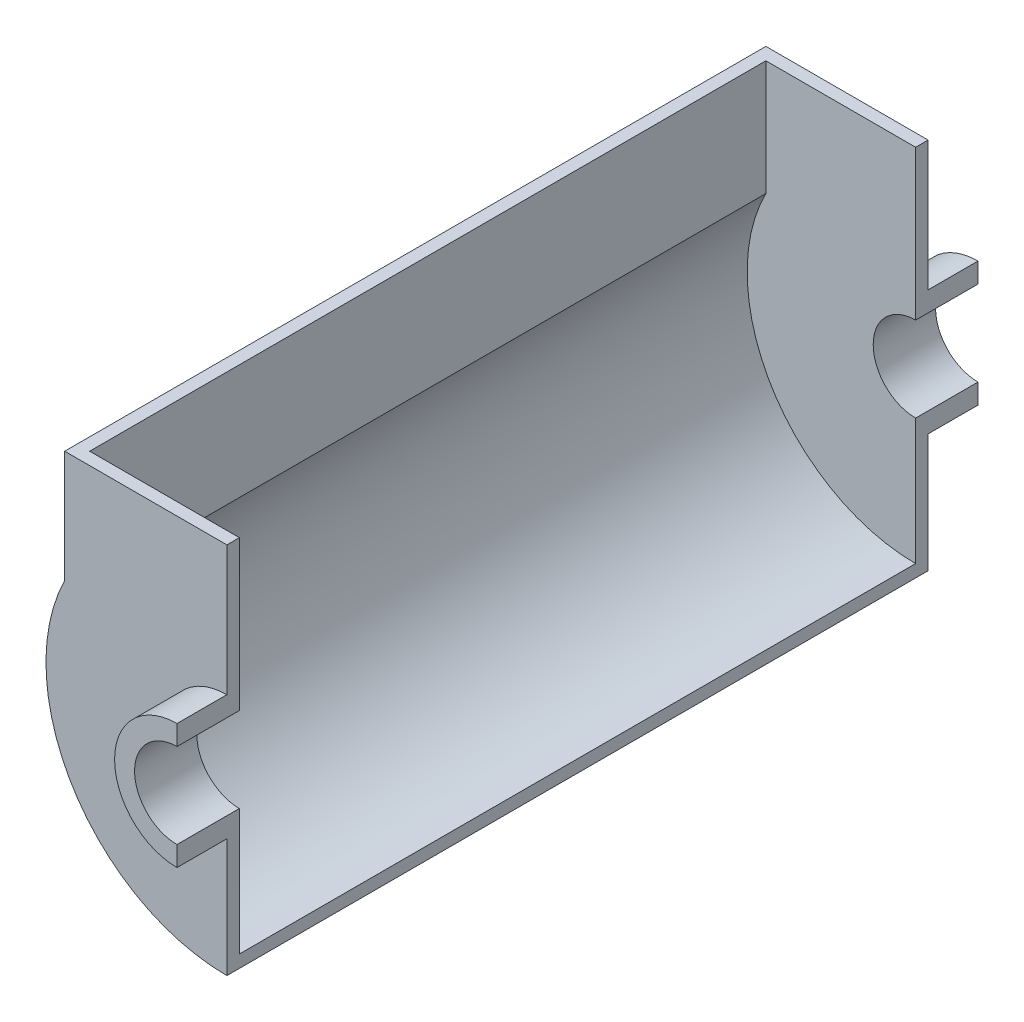
ISO-10303-21;
HEADER;
FILE_DESCRIPTION(('STEP AP214'),'2;1');
FILE_NAME('part.step','',(''),(''),'','','');
FILE_SCHEMA(('AUTOMOTIVE_DESIGN { 1 0 10303 214 1 1 1 1 }'));
ENDSEC;
DATA;
#1=APPLICATION_CONTEXT('core data for automotive mechanical design processes');
#2=APPLICATION_PROTOCOL_DEFINITION('international standard','automotive_design',2000,#1);
#3=PRODUCT_CONTEXT('',#1,'mechanical');
#4=PRODUCT('Part','Part','',(#3));
#5=PRODUCT_RELATED_PRODUCT_CATEGORY('part','',(#4));
#6=PRODUCT_DEFINITION_FORMATION('','',#4);
#7=PRODUCT_DEFINITION_CONTEXT('part definition',#1,'design');
#8=PRODUCT_DEFINITION('design','',#6,#7);
#9=PRODUCT_DEFINITION_SHAPE('','',#8);
#10=(LENGTH_UNIT() NAMED_UNIT(*) SI_UNIT(.MILLI.,.METRE.));
#11=(NAMED_UNIT(*) PLANE_ANGLE_UNIT() SI_UNIT($,.RADIAN.));
#12=(NAMED_UNIT(*) SI_UNIT($,.STERADIAN.) SOLID_ANGLE_UNIT());
#13=UNCERTAINTY_MEASURE_WITH_UNIT(LENGTH_MEASURE(1.E-05),#10,'distance_accuracy_value','');
#14=(GEOMETRIC_REPRESENTATION_CONTEXT(3) GLOBAL_UNCERTAINTY_ASSIGNED_CONTEXT((#13)) GLOBAL_UNIT_ASSIGNED_CONTEXT((#10,
#11,#12)) REPRESENTATION_CONTEXT('',''));
#15=CARTESIAN_POINT('',(0.,0.,0.));
#16=DIRECTION('',(0.,0.,1.));
#17=DIRECTION('',(1.,0.,0.));
#18=AXIS2_PLACEMENT_3D('',#15,#16,#17);
#19=CARTESIAN_POINT('',(0.,0.,-127.));
#20=DIRECTION('',(0.,0.,1.));
#21=DIRECTION('',(1.,0.,0.));
#22=AXIS2_PLACEMENT_3D('',#19,#20,#21);
#23=PLANE('',#22);
#24=CARTESIAN_POINT('',(0.,0.,-127.));
#25=DIRECTION('',(0.,0.,1.));
#26=DIRECTION('',(-1.,0.,0.));
#27=AXIS2_PLACEMENT_3D('',#24,#25,#26);
#28=CIRCLE('',#27,1714.5);
#29=CARTESIAN_POINT('',(-1524.,785.451621680164,-127.));
#30=VERTEX_POINT('',#29);
#31=CARTESIAN_POINT('',(0.,-1714.5,-127.));
#32=VERTEX_POINT('',#31);
#33=EDGE_CURVE('E196',#30,#32,#28,.T.);
#34=ORIENTED_EDGE('',*,*,#33,.F.);
#35=DIRECTION('',(0.,-1.,0.));
#36=VECTOR('',#35,1.);
#37=CARTESIAN_POINT('',(-1524.,1955.8,-127.));
#38=LINE('',#37,#36);
#39=CARTESIAN_POINT('',(-1524.,1955.8,-127.));
#40=VERTEX_POINT('',#39);
#41=EDGE_CURVE('E53',#40,#30,#38,.T.);
#42=ORIENTED_EDGE('',*,*,#41,.F.);
#43=DIRECTION('',(-1.,0.,0.));
#44=VECTOR('',#43,1.);
#45=CARTESIAN_POINT('',(0.,1955.8,-127.));
#46=LINE('',#45,#44);
#47=CARTESIAN_POINT('',(0.,1955.8,-127.));
#48=VERTEX_POINT('',#47);
#49=EDGE_CURVE('E212',#48,#40,#46,.T.);
#50=ORIENTED_EDGE('',*,*,#49,.F.);
#51=DIRECTION('',(0.,1.,0.));
#52=VECTOR('',#51,1.);
#53=CARTESIAN_POINT('',(0.,635.,-127.));
#54=LINE('',#53,#52);
#55=CARTESIAN_POINT('',(0.,431.8,-127.));
#56=VERTEX_POINT('',#55);
#57=EDGE_CURVE('E254',#56,#48,#54,.T.);
#58=ORIENTED_EDGE('',*,*,#57,.F.);
#59=CARTESIAN_POINT('',(0.,0.,-127.));
#60=DIRECTION('',(0.,0.,-1.));
#61=DIRECTION('',(1.,0.,0.));
#62=AXIS2_PLACEMENT_3D('',#59,#60,#61);
#63=CIRCLE('',#62,431.8);
#64=CARTESIAN_POINT('',(0.,-431.8,-127.));
#65=VERTEX_POINT('',#64);
#66=EDGE_CURVE('E251',#65,#56,#63,.T.);
#67=ORIENTED_EDGE('',*,*,#66,.F.);
#68=DIRECTION('',(0.,1.,0.));
#69=VECTOR('',#68,1.);
#70=CARTESIAN_POINT('',(0.,-431.8,-127.));
#71=LINE('',#70,#69);
#72=EDGE_CURVE('E59',#32,#65,#71,.T.);
#73=ORIENTED_EDGE('',*,*,#72,.F.);
#74=EDGE_LOOP('',(#34,#42,#50,#58,#67,#73));
#75=FACE_BOUND('',#74,.T.);
#76=ADVANCED_FACE('F36',(#75),#23,.F.);
#77=CARTESIAN_POINT('',(0.,0.,-127.));
#78=DIRECTION('',(0.,0.,1.));
#79=DIRECTION('',(1.,0.,0.));
#80=AXIS2_PLACEMENT_3D('',#77,#78,#79);
#81=CYLINDRICAL_SURFACE('',#80,431.8);
#82=DIRECTION('',(0.,0.,1.));
#83=VECTOR('',#82,1.);
#84=CARTESIAN_POINT('',(0.,431.8,-127.));
#85=LINE('',#84,#83);
#86=CARTESIAN_POINT('',(0.,431.8,508.));
#87=VERTEX_POINT('',#86);
#88=EDGE_CURVE('E40',#56,#87,#85,.T.);
#89=ORIENTED_EDGE('',*,*,#88,.T.);
#90=CARTESIAN_POINT('',(0.,0.,508.));
#91=DIRECTION('',(0.,0.,-1.));
#92=DIRECTION('',(1.,0.,0.));
#93=AXIS2_PLACEMENT_3D('',#90,#91,#92);
#94=CIRCLE('',#93,431.8);
#95=CARTESIAN_POINT('',(0.,-431.8,508.));
#96=VERTEX_POINT('',#95);
#97=EDGE_CURVE('E234',#96,#87,#94,.T.);
#98=ORIENTED_EDGE('',*,*,#97,.F.);
#99=DIRECTION('',(0.,0.,1.));
#100=VECTOR('',#99,1.);
#101=CARTESIAN_POINT('',(0.,-431.8,-127.));
#102=LINE('',#101,#100);
#103=EDGE_CURVE('E11',#65,#96,#102,.T.);
#104=ORIENTED_EDGE('',*,*,#103,.F.);
#105=ORIENTED_EDGE('',*,*,#66,.T.);
#106=EDGE_LOOP('',(#89,#98,#104,#105));
#107=FACE_BOUND('',#106,.T.);
#108=ADVANCED_FACE('F38',(#107),#81,.F.);
#109=CARTESIAN_POINT('',(0.,-431.8,-127.));
#110=DIRECTION('',(1.,0.,0.));
#111=DIRECTION('',(0.,0.,-1.));
#112=AXIS2_PLACEMENT_3D('',#109,#110,#111);
#113=PLANE('',#112);
#114=ORIENTED_EDGE('',*,*,#103,.T.);
#115=DIRECTION('',(0.,1.,0.));
#116=VECTOR('',#115,1.);
#117=CARTESIAN_POINT('',(0.,-431.8,508.));
#118=LINE('',#117,#116);
#119=CARTESIAN_POINT('',(0.,-635.,508.));
#120=VERTEX_POINT('',#119);
#121=EDGE_CURVE('E248',#120,#96,#118,.T.);
#122=ORIENTED_EDGE('',*,*,#121,.F.);
#123=DIRECTION('',(0.,0.,1.));
#124=VECTOR('',#123,1.);
#125=CARTESIAN_POINT('',(0.,-635.,-127.));
#126=LINE('',#125,#124);
#127=CARTESIAN_POINT('',(0.,-635.,0.));
#128=VERTEX_POINT('',#127);
#129=EDGE_CURVE('E45',#128,#120,#126,.T.);
#130=ORIENTED_EDGE('',*,*,#129,.F.);
#131=DIRECTION('',(0.,1.,0.));
#132=VECTOR('',#131,1.);
#133=CARTESIAN_POINT('',(0.,-635.,0.));
#134=LINE('',#133,#132);
#135=CARTESIAN_POINT('',(1.47753636317128E-13,-1841.5,0.));
#136=VERTEX_POINT('',#135);
#137=EDGE_CURVE('E215',#136,#128,#134,.T.);
#138=ORIENTED_EDGE('',*,*,#137,.F.);
#139=DIRECTION('',(0.,0.,1.));
#140=VECTOR('',#139,1.);
#141=CARTESIAN_POINT('',(1.47753636317128E-13,-1841.5,-127.));
#142=LINE('',#141,#140);
#143=CARTESIAN_POINT('',(1.47753636317128E-13,-1841.5,-7137.4));
#144=VERTEX_POINT('',#143);
#145=EDGE_CURVE('E232',#144,#136,#142,.T.);
#146=ORIENTED_EDGE('',*,*,#145,.F.);
#147=DIRECTION('',(0.,1.,0.));
#148=VECTOR('',#147,1.);
#149=CARTESIAN_POINT('',(0.,-635.,-7137.4));
#150=LINE('',#149,#148);
#151=CARTESIAN_POINT('',(0.,-635.,-7137.4));
#152=VERTEX_POINT('',#151);
#153=EDGE_CURVE('E163',#144,#152,#150,.T.);
#154=ORIENTED_EDGE('',*,*,#153,.T.);
#155=DIRECTION('',(0.,0.,-1.));
#156=VECTOR('',#155,1.);
#157=CARTESIAN_POINT('',(0.,-635.,-7010.4));
#158=LINE('',#157,#156);
#159=CARTESIAN_POINT('',(0.,-635.,-7645.4));
#160=VERTEX_POINT('',#159);
#161=EDGE_CURVE('E189',#152,#160,#158,.T.);
#162=ORIENTED_EDGE('',*,*,#161,.T.);
#163=DIRECTION('',(0.,1.,0.));
#164=VECTOR('',#163,1.);
#165=CARTESIAN_POINT('',(0.,-431.8,-7645.4));
#166=LINE('',#165,#164);
#167=CARTESIAN_POINT('',(0.,-431.8,-7645.4));
#168=VERTEX_POINT('',#167);
#169=EDGE_CURVE('E182',#160,#168,#166,.T.);
#170=ORIENTED_EDGE('',*,*,#169,.T.);
#171=DIRECTION('',(0.,0.,-1.));
#172=VECTOR('',#171,1.);
#173=CARTESIAN_POINT('',(0.,-431.8,-7010.4));
#174=LINE('',#173,#172);
#175=CARTESIAN_POINT('',(0.,-431.8,-7010.4));
#176=VERTEX_POINT('',#175);
#177=EDGE_CURVE('E186',#176,#168,#174,.T.);
#178=ORIENTED_EDGE('',*,*,#177,.F.);
#179=DIRECTION('',(0.,1.,0.));
#180=VECTOR('',#179,1.);
#181=CARTESIAN_POINT('',(0.,-431.8,-7010.4));
#182=LINE('',#181,#180);
#183=CARTESIAN_POINT('',(0.,-1714.5,-7010.4));
#184=VERTEX_POINT('',#183);
#185=EDGE_CURVE('E178',#184,#176,#182,.T.);
#186=ORIENTED_EDGE('',*,*,#185,.F.);
#187=DIRECTION('',(0.,0.,1.));
#188=VECTOR('',#187,1.);
#189=CARTESIAN_POINT('',(3.14948540570721E-13,-1714.5,-11230.661785719));
#190=LINE('',#189,#188);
#191=EDGE_CURVE('E199',#184,#32,#190,.T.);
#192=ORIENTED_EDGE('',*,*,#191,.T.);
#193=ORIENTED_EDGE('',*,*,#72,.T.);
#194=EDGE_LOOP('',(#114,#122,#130,#138,#146,#154,#162,#170,#178,#186,#192,#193));
#195=FACE_BOUND('',#194,.T.);
#196=ADVANCED_FACE('F272',(#195),#113,.T.);
#197=CARTESIAN_POINT('',(0.,0.,-127.));
#198=DIRECTION('',(0.,0.,1.));
#199=DIRECTION('',(1.,0.,0.));
#200=AXIS2_PLACEMENT_3D('',#197,#198,#199);
#201=CYLINDRICAL_SURFACE('',#200,635.);
#202=CARTESIAN_POINT('',(0.,0.,0.));
#203=DIRECTION('',(0.,0.,-1.));
#204=DIRECTION('',(1.,0.,0.));
#205=AXIS2_PLACEMENT_3D('',#202,#203,#204);
#206=CIRCLE('',#205,635.);
#207=CARTESIAN_POINT('',(0.,635.,0.));
#208=VERTEX_POINT('',#207);
#209=EDGE_CURVE('E205',#128,#208,#206,.T.);
#210=ORIENTED_EDGE('',*,*,#209,.F.);
#211=ORIENTED_EDGE('',*,*,#129,.T.);
#212=CARTESIAN_POINT('',(0.,0.,508.));
#213=DIRECTION('',(0.,0.,1.));
#214=DIRECTION('',(1.,0.,0.));
#215=AXIS2_PLACEMENT_3D('',#212,#213,#214);
#216=CIRCLE('',#215,635.);
#217=CARTESIAN_POINT('',(0.,635.,508.));
#218=VERTEX_POINT('',#217);
#219=EDGE_CURVE('E245',#218,#120,#216,.T.);
#220=ORIENTED_EDGE('',*,*,#219,.F.);
#221=DIRECTION('',(0.,0.,1.));
#222=VECTOR('',#221,1.);
#223=CARTESIAN_POINT('',(0.,635.,-127.));
#224=LINE('',#223,#222);
#225=EDGE_CURVE('E257',#208,#218,#224,.T.);
#226=ORIENTED_EDGE('',*,*,#225,.F.);
#227=EDGE_LOOP('',(#210,#211,#220,#226));
#228=FACE_BOUND('',#227,.T.);
#229=ADVANCED_FACE('F279',(#228),#201,.T.);
#230=CARTESIAN_POINT('',(0.,635.,-127.));
#231=DIRECTION('',(1.,0.,0.));
#232=DIRECTION('',(0.,0.,-1.));
#233=AXIS2_PLACEMENT_3D('',#230,#231,#232);
#234=PLANE('',#233);
#235=ORIENTED_EDGE('',*,*,#57,.T.);
#236=DIRECTION('',(0.,0.,1.));
#237=VECTOR('',#236,1.);
#238=CARTESIAN_POINT('',(0.,1955.8,-127.));
#239=LINE('',#238,#237);
#240=CARTESIAN_POINT('',(0.,1955.8,0.));
#241=VERTEX_POINT('',#240);
#242=EDGE_CURVE('E214',#48,#241,#239,.T.);
#243=ORIENTED_EDGE('',*,*,#242,.T.);
#244=DIRECTION('',(0.,1.,0.));
#245=VECTOR('',#244,1.);
#246=CARTESIAN_POINT('',(0.,635.,0.));
#247=LINE('',#246,#245);
#248=EDGE_CURVE('E218',#208,#241,#247,.T.);
#249=ORIENTED_EDGE('',*,*,#248,.F.);
#250=ORIENTED_EDGE('',*,*,#225,.T.);
#251=DIRECTION('',(0.,1.,0.));
#252=VECTOR('',#251,1.);
#253=CARTESIAN_POINT('',(0.,635.,508.));
#254=LINE('',#253,#252);
#255=EDGE_CURVE('E242',#87,#218,#254,.T.);
#256=ORIENTED_EDGE('',*,*,#255,.F.);
#257=ORIENTED_EDGE('',*,*,#88,.F.);
#258=EDGE_LOOP('',(#235,#243,#249,#250,#256,#257));
#259=FACE_BOUND('',#258,.T.);
#260=ADVANCED_FACE('F265',(#259),#234,.T.);
#261=CARTESIAN_POINT('',(0.,0.,508.));
#262=DIRECTION('',(0.,0.,1.));
#263=DIRECTION('',(1.,0.,0.));
#264=AXIS2_PLACEMENT_3D('',#261,#262,#263);
#265=PLANE('',#264);
#266=ORIENTED_EDGE('',*,*,#97,.T.);
#267=ORIENTED_EDGE('',*,*,#255,.T.);
#268=ORIENTED_EDGE('',*,*,#219,.T.);
#269=ORIENTED_EDGE('',*,*,#121,.T.);
#270=EDGE_LOOP('',(#266,#267,#268,#269));
#271=FACE_BOUND('',#270,.T.);
#272=ADVANCED_FACE('F268',(#271),#265,.T.);
#273=CARTESIAN_POINT('',(0.,0.,-127.));
#274=DIRECTION('',(0.,0.,1.));
#275=DIRECTION('',(1.,0.,0.));
#276=AXIS2_PLACEMENT_3D('',#273,#274,#275);
#277=CYLINDRICAL_SURFACE('',#276,1841.5);
#278=CARTESIAN_POINT('',(0.,0.,0.));
#279=DIRECTION('',(0.,0.,1.));
#280=DIRECTION('',(1.,0.,0.));
#281=AXIS2_PLACEMENT_3D('',#278,#279,#280);
#282=CIRCLE('',#281,1841.5);
#283=CARTESIAN_POINT('',(-1651.,815.672268745235,0.));
#284=VERTEX_POINT('',#283);
#285=EDGE_CURVE('E227',#284,#136,#282,.T.);
#286=ORIENTED_EDGE('',*,*,#285,.F.);
#287=DIRECTION('',(0.,0.,1.));
#288=VECTOR('',#287,1.);
#289=CARTESIAN_POINT('',(-1651.,815.672268745235,-127.));
#290=LINE('',#289,#288);
#291=CARTESIAN_POINT('',(-1651.,815.672268745235,-7137.4));
#292=VERTEX_POINT('',#291);
#293=EDGE_CURVE('E235',#292,#284,#290,.T.);
#294=ORIENTED_EDGE('',*,*,#293,.F.);
#295=CARTESIAN_POINT('',(0.,0.,-7137.4));
#296=DIRECTION('',(0.,0.,1.));
#297=DIRECTION('',(1.,0.,0.));
#298=AXIS2_PLACEMENT_3D('',#295,#296,#297);
#299=CIRCLE('',#298,1841.5);
#300=EDGE_CURVE('E347',#292,#144,#299,.T.);
#301=ORIENTED_EDGE('',*,*,#300,.T.);
#302=ORIENTED_EDGE('',*,*,#145,.T.);
#303=EDGE_LOOP('',(#286,#294,#301,#302));
#304=FACE_BOUND('',#303,.T.);
#305=ADVANCED_FACE('F295',(#304),#277,.T.);
#306=CARTESIAN_POINT('',(-1651.,1955.8,-127.));
#307=DIRECTION('',(-1.,0.,0.));
#308=DIRECTION('',(0.,-1.,0.));
#309=AXIS2_PLACEMENT_3D('',#306,#307,#308);
#310=PLANE('',#309);
#311=DIRECTION('',(0.,-1.,0.));
#312=VECTOR('',#311,1.);
#313=CARTESIAN_POINT('',(-1651.,1955.8,0.));
#314=LINE('',#313,#312);
#315=CARTESIAN_POINT('',(-1651.,1955.8,0.));
#316=VERTEX_POINT('',#315);
#317=EDGE_CURVE('E224',#316,#284,#314,.T.);
#318=ORIENTED_EDGE('',*,*,#317,.F.);
#319=DIRECTION('',(0.,0.,1.));
#320=VECTOR('',#319,1.);
#321=CARTESIAN_POINT('',(-1651.,1955.8,-127.));
#322=LINE('',#321,#320);
#323=CARTESIAN_POINT('',(-1651.,1955.8,-7137.4));
#324=VERTEX_POINT('',#323);
#325=EDGE_CURVE('E237',#324,#316,#322,.T.);
#326=ORIENTED_EDGE('',*,*,#325,.F.);
#327=DIRECTION('',(0.,-1.,0.));
#328=VECTOR('',#327,1.);
#329=CARTESIAN_POINT('',(-1651.,1955.8,-7137.4));
#330=LINE('',#329,#328);
#331=EDGE_CURVE('E349',#324,#292,#330,.T.);
#332=ORIENTED_EDGE('',*,*,#331,.T.);
#333=ORIENTED_EDGE('',*,*,#293,.T.);
#334=EDGE_LOOP('',(#318,#326,#332,#333));
#335=FACE_BOUND('',#334,.T.);
#336=ADVANCED_FACE('F298',(#335),#310,.T.);
#337=CARTESIAN_POINT('',(0.,1955.8,-127.));
#338=DIRECTION('',(0.,1.,0.));
#339=DIRECTION('',(-1.,0.,0.));
#340=AXIS2_PLACEMENT_3D('',#337,#338,#339);
#341=PLANE('',#340);
#342=DIRECTION('',(-1.,0.,0.));
#343=VECTOR('',#342,1.);
#344=CARTESIAN_POINT('',(0.,1955.8,0.));
#345=LINE('',#344,#343);
#346=EDGE_CURVE('E221',#241,#316,#345,.T.);
#347=ORIENTED_EDGE('',*,*,#346,.F.);
#348=ORIENTED_EDGE('',*,*,#242,.F.);
#349=ORIENTED_EDGE('',*,*,#49,.T.);
#350=DIRECTION('',(0.,0.,1.));
#351=VECTOR('',#350,1.);
#352=CARTESIAN_POINT('',(-1524.,1955.8,-11230.661785719));
#353=LINE('',#352,#351);
#354=CARTESIAN_POINT('',(-1524.,1955.8,-7010.4));
#355=VERTEX_POINT('',#354);
#356=EDGE_CURVE('E159',#355,#40,#353,.T.);
#357=ORIENTED_EDGE('',*,*,#356,.F.);
#358=DIRECTION('',(-1.,0.,0.));
#359=VECTOR('',#358,1.);
#360=CARTESIAN_POINT('',(0.,1955.8,-7010.4));
#361=LINE('',#360,#359);
#362=CARTESIAN_POINT('',(0.,1955.8,-7010.4));
#363=VERTEX_POINT('',#362);
#364=EDGE_CURVE('E151',#363,#355,#361,.T.);
#365=ORIENTED_EDGE('',*,*,#364,.F.);
#366=DIRECTION('',(0.,0.,-1.));
#367=VECTOR('',#366,1.);
#368=CARTESIAN_POINT('',(0.,1955.8,-7010.4));
#369=LINE('',#368,#367);
#370=CARTESIAN_POINT('',(0.,1955.8,-7137.4));
#371=VERTEX_POINT('',#370);
#372=EDGE_CURVE('E156',#363,#371,#369,.T.);
#373=ORIENTED_EDGE('',*,*,#372,.T.);
#374=DIRECTION('',(-1.,0.,0.));
#375=VECTOR('',#374,1.);
#376=CARTESIAN_POINT('',(0.,1955.8,-7137.4));
#377=LINE('',#376,#375);
#378=EDGE_CURVE('E363',#371,#324,#377,.T.);
#379=ORIENTED_EDGE('',*,*,#378,.T.);
#380=ORIENTED_EDGE('',*,*,#325,.T.);
#381=EDGE_LOOP('',(#347,#348,#349,#357,#365,#373,#379,#380));
#382=FACE_BOUND('',#381,.T.);
#383=ADVANCED_FACE('F154',(#382),#341,.T.);
#384=CARTESIAN_POINT('',(0.,0.,0.));
#385=DIRECTION('',(0.,0.,1.));
#386=DIRECTION('',(1.,0.,0.));
#387=AXIS2_PLACEMENT_3D('',#384,#385,#386);
#388=PLANE('',#387);
#389=ORIENTED_EDGE('',*,*,#209,.T.);
#390=ORIENTED_EDGE('',*,*,#248,.T.);
#391=ORIENTED_EDGE('',*,*,#346,.T.);
#392=ORIENTED_EDGE('',*,*,#317,.T.);
#393=ORIENTED_EDGE('',*,*,#285,.T.);
#394=ORIENTED_EDGE('',*,*,#137,.T.);
#395=EDGE_LOOP('',(#389,#390,#391,#392,#393,#394));
#396=FACE_BOUND('',#395,.T.);
#397=ADVANCED_FACE('F277',(#396),#388,.T.);
#398=CARTESIAN_POINT('',(-1524.,1955.8,-11230.661785719));
#399=DIRECTION('',(-1.,0.,0.));
#400=DIRECTION('',(0.,0.,1.));
#401=AXIS2_PLACEMENT_3D('',#398,#399,#400);
#402=PLANE('',#401);
#403=DIRECTION('',(0.,-1.,0.));
#404=VECTOR('',#403,1.);
#405=CARTESIAN_POINT('',(-1524.,1955.8,-7010.4));
#406=LINE('',#405,#404);
#407=CARTESIAN_POINT('',(-1524.,785.451621680164,-7010.4));
#408=VERTEX_POINT('',#407);
#409=EDGE_CURVE('E206',#355,#408,#406,.T.);
#410=ORIENTED_EDGE('',*,*,#409,.F.);
#411=ORIENTED_EDGE('',*,*,#356,.T.);
#412=ORIENTED_EDGE('',*,*,#41,.T.);
#413=DIRECTION('',(0.,0.,1.));
#414=VECTOR('',#413,1.);
#415=CARTESIAN_POINT('',(-1524.,785.451621680164,-11230.661785719));
#416=LINE('',#415,#414);
#417=EDGE_CURVE('E200',#408,#30,#416,.T.);
#418=ORIENTED_EDGE('',*,*,#417,.F.);
#419=EDGE_LOOP('',(#410,#411,#412,#418));
#420=FACE_BOUND('',#419,.T.);
#421=ADVANCED_FACE('F307',(#420),#402,.F.);
#422=CARTESIAN_POINT('',(0.,0.,-11230.661785719));
#423=DIRECTION('',(0.,0.,1.));
#424=DIRECTION('',(1.,0.,0.));
#425=AXIS2_PLACEMENT_3D('',#422,#423,#424);
#426=CYLINDRICAL_SURFACE('',#425,1714.5);
#427=CARTESIAN_POINT('',(0.,0.,-7010.4));
#428=DIRECTION('',(0.,0.,-1.));
#429=DIRECTION('',(-1.,0.,0.));
#430=AXIS2_PLACEMENT_3D('',#427,#428,#429);
#431=CIRCLE('',#430,1714.5);
#432=EDGE_CURVE('E202',#408,#184,#431,.F.);
#433=ORIENTED_EDGE('',*,*,#432,.F.);
#434=ORIENTED_EDGE('',*,*,#417,.T.);
#435=ORIENTED_EDGE('',*,*,#33,.T.);
#436=ORIENTED_EDGE('',*,*,#191,.F.);
#437=EDGE_LOOP('',(#433,#434,#435,#436));
#438=FACE_BOUND('',#437,.T.);
#439=ADVANCED_FACE('F310',(#438),#426,.F.);
#440=CARTESIAN_POINT('',(0.,0.,-7010.4));
#441=DIRECTION('',(0.,0.,-1.));
#442=DIRECTION('',(1.,0.,0.));
#443=AXIS2_PLACEMENT_3D('',#440,#441,#442);
#444=PLANE('',#443);
#445=ORIENTED_EDGE('',*,*,#364,.T.);
#446=ORIENTED_EDGE('',*,*,#409,.T.);
#447=ORIENTED_EDGE('',*,*,#432,.T.);
#448=ORIENTED_EDGE('',*,*,#185,.T.);
#449=CARTESIAN_POINT('',(0.,0.,-7010.4));
#450=DIRECTION('',(0.,0.,-1.));
#451=DIRECTION('',(1.,0.,0.));
#452=AXIS2_PLACEMENT_3D('',#449,#450,#451);
#453=CIRCLE('',#452,431.8);
#454=CARTESIAN_POINT('',(0.,431.8,-7010.4));
#455=VERTEX_POINT('',#454);
#456=EDGE_CURVE('E176',#176,#455,#453,.T.);
#457=ORIENTED_EDGE('',*,*,#456,.T.);
#458=DIRECTION('',(0.,1.,0.));
#459=VECTOR('',#458,1.);
#460=CARTESIAN_POINT('',(0.,635.,-7010.4));
#461=LINE('',#460,#459);
#462=EDGE_CURVE('E168',#455,#363,#461,.T.);
#463=ORIENTED_EDGE('',*,*,#462,.T.);
#464=EDGE_LOOP('',(#445,#446,#447,#448,#457,#463));
#465=FACE_BOUND('',#464,.T.);
#466=ADVANCED_FACE('F174',(#465),#444,.F.);
#467=CARTESIAN_POINT('',(0.,0.,-7010.4));
#468=DIRECTION('',(0.,0.,-1.));
#469=DIRECTION('',(1.,0.,0.));
#470=AXIS2_PLACEMENT_3D('',#467,#468,#469);
#471=CYLINDRICAL_SURFACE('',#470,431.8);
#472=DIRECTION('',(0.,0.,-1.));
#473=VECTOR('',#472,1.);
#474=CARTESIAN_POINT('',(0.,431.8,-7010.4));
#475=LINE('',#474,#473);
#476=CARTESIAN_POINT('',(0.,431.8,-7645.4));
#477=VERTEX_POINT('',#476);
#478=EDGE_CURVE('E180',#455,#477,#475,.T.);
#479=ORIENTED_EDGE('',*,*,#478,.F.);
#480=ORIENTED_EDGE('',*,*,#456,.F.);
#481=ORIENTED_EDGE('',*,*,#177,.T.);
#482=CARTESIAN_POINT('',(0.,0.,-7645.4));
#483=DIRECTION('',(0.,0.,-1.));
#484=DIRECTION('',(1.,0.,0.));
#485=AXIS2_PLACEMENT_3D('',#482,#483,#484);
#486=CIRCLE('',#485,431.8);
#487=EDGE_CURVE('E172',#168,#477,#486,.T.);
#488=ORIENTED_EDGE('',*,*,#487,.T.);
#489=EDGE_LOOP('',(#479,#480,#481,#488));
#490=FACE_BOUND('',#489,.T.);
#491=ADVANCED_FACE('F315',(#490),#471,.F.);
#492=CARTESIAN_POINT('',(0.,0.,-7010.4));
#493=DIRECTION('',(0.,0.,-1.));
#494=DIRECTION('',(1.,0.,0.));
#495=AXIS2_PLACEMENT_3D('',#492,#493,#494);
#496=CYLINDRICAL_SURFACE('',#495,635.);
#497=CARTESIAN_POINT('',(0.,0.,-7137.4));
#498=DIRECTION('',(0.,0.,-1.));
#499=DIRECTION('',(1.,0.,0.));
#500=AXIS2_PLACEMENT_3D('',#497,#498,#499);
#501=CIRCLE('',#500,635.);
#502=CARTESIAN_POINT('',(0.,635.,-7137.4));
#503=VERTEX_POINT('',#502);
#504=EDGE_CURVE('E338',#152,#503,#501,.T.);
#505=ORIENTED_EDGE('',*,*,#504,.T.);
#506=DIRECTION('',(0.,0.,-1.));
#507=VECTOR('',#506,1.);
#508=CARTESIAN_POINT('',(0.,635.,-7010.4));
#509=LINE('',#508,#507);
#510=CARTESIAN_POINT('',(0.,635.,-7645.4));
#511=VERTEX_POINT('',#510);
#512=EDGE_CURVE('E192',#503,#511,#509,.T.);
#513=ORIENTED_EDGE('',*,*,#512,.T.);
#514=CARTESIAN_POINT('',(0.,0.,-7645.4));
#515=DIRECTION('',(0.,0.,1.));
#516=DIRECTION('',(1.,0.,0.));
#517=AXIS2_PLACEMENT_3D('',#514,#515,#516);
#518=CIRCLE('',#517,635.);
#519=EDGE_CURVE('E344',#511,#160,#518,.T.);
#520=ORIENTED_EDGE('',*,*,#519,.T.);
#521=ORIENTED_EDGE('',*,*,#161,.F.);
#522=EDGE_LOOP('',(#505,#513,#520,#521));
#523=FACE_BOUND('',#522,.T.);
#524=ADVANCED_FACE('F318',(#523),#496,.T.);
#525=CARTESIAN_POINT('',(0.,635.,-7010.4));
#526=DIRECTION('',(1.,0.,0.));
#527=DIRECTION('',(0.,0.,1.));
#528=AXIS2_PLACEMENT_3D('',#525,#526,#527);
#529=PLANE('',#528);
#530=ORIENTED_EDGE('',*,*,#462,.F.);
#531=ORIENTED_EDGE('',*,*,#478,.T.);
#532=DIRECTION('',(0.,1.,0.));
#533=VECTOR('',#532,1.);
#534=CARTESIAN_POINT('',(0.,635.,-7645.4));
#535=LINE('',#534,#533);
#536=EDGE_CURVE('E355',#477,#511,#535,.T.);
#537=ORIENTED_EDGE('',*,*,#536,.T.);
#538=ORIENTED_EDGE('',*,*,#512,.F.);
#539=DIRECTION('',(0.,1.,0.));
#540=VECTOR('',#539,1.);
#541=CARTESIAN_POINT('',(0.,635.,-7137.4));
#542=LINE('',#541,#540);
#543=EDGE_CURVE('E171',#503,#371,#542,.T.);
#544=ORIENTED_EDGE('',*,*,#543,.T.);
#545=ORIENTED_EDGE('',*,*,#372,.F.);
#546=EDGE_LOOP('',(#530,#531,#537,#538,#544,#545));
#547=FACE_BOUND('',#546,.T.);
#548=ADVANCED_FACE('F166',(#547),#529,.T.);
#549=CARTESIAN_POINT('',(0.,0.,-7645.4));
#550=DIRECTION('',(0.,0.,-1.));
#551=DIRECTION('',(1.,0.,0.));
#552=AXIS2_PLACEMENT_3D('',#549,#550,#551);
#553=PLANE('',#552);
#554=ORIENTED_EDGE('',*,*,#487,.F.);
#555=ORIENTED_EDGE('',*,*,#169,.F.);
#556=ORIENTED_EDGE('',*,*,#519,.F.);
#557=ORIENTED_EDGE('',*,*,#536,.F.);
#558=EDGE_LOOP('',(#554,#555,#556,#557));
#559=FACE_BOUND('',#558,.T.);
#560=ADVANCED_FACE('F322',(#559),#553,.T.);
#561=CARTESIAN_POINT('',(0.,0.,-7137.4));
#562=DIRECTION('',(0.,0.,-1.));
#563=DIRECTION('',(1.,0.,0.));
#564=AXIS2_PLACEMENT_3D('',#561,#562,#563);
#565=PLANE('',#564);
#566=ORIENTED_EDGE('',*,*,#504,.F.);
#567=ORIENTED_EDGE('',*,*,#153,.F.);
#568=ORIENTED_EDGE('',*,*,#300,.F.);
#569=ORIENTED_EDGE('',*,*,#331,.F.);
#570=ORIENTED_EDGE('',*,*,#378,.F.);
#571=ORIENTED_EDGE('',*,*,#543,.F.);
#572=EDGE_LOOP('',(#566,#567,#568,#569,#570,#571));
#573=FACE_BOUND('',#572,.T.);
#574=ADVANCED_FACE('F330',(#573),#565,.T.);
#575=CLOSED_SHELL('',(#76,#108,#196,#229,#260,#272,#305,#336,#383,#397,#421,#439,#466,#491,#524,
#548,#560,#574));
#576=MANIFOLD_SOLID_BREP('B2',#575);
#577=ADVANCED_BREP_SHAPE_REPRESENTATION('',(#18,#576),#14);
#578=SHAPE_DEFINITION_REPRESENTATION(#9,#577);
ENDSEC;
END-ISO-10303-21;
